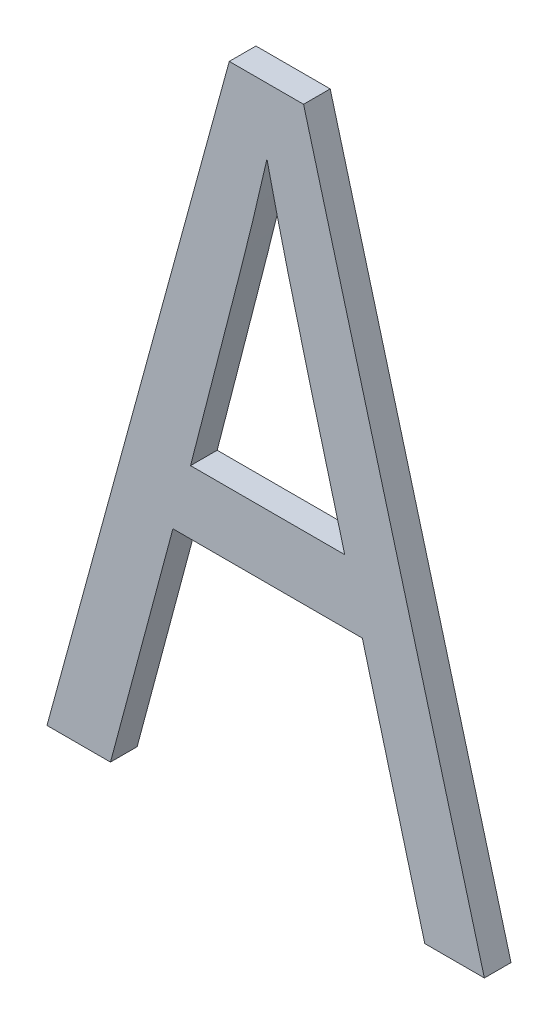
ISO-10303-21;
HEADER;
FILE_DESCRIPTION(('STEP AP214'),'2;1');
FILE_NAME('part.step','',(''),(''),'','','');
FILE_SCHEMA(('AUTOMOTIVE_DESIGN { 1 0 10303 214 1 1 1 1 }'));
ENDSEC;
DATA;
#1=APPLICATION_CONTEXT('core data for automotive mechanical design processes');
#2=APPLICATION_PROTOCOL_DEFINITION('international standard','automotive_design',2000,#1);
#3=PRODUCT_CONTEXT('',#1,'mechanical');
#4=PRODUCT('Part','Part','',(#3));
#5=PRODUCT_RELATED_PRODUCT_CATEGORY('part','',(#4));
#6=PRODUCT_DEFINITION_FORMATION('','',#4);
#7=PRODUCT_DEFINITION_CONTEXT('part definition',#1,'design');
#8=PRODUCT_DEFINITION('design','',#6,#7);
#9=PRODUCT_DEFINITION_SHAPE('','',#8);
#10=(LENGTH_UNIT() NAMED_UNIT(*) SI_UNIT(.MILLI.,.METRE.));
#11=(NAMED_UNIT(*) PLANE_ANGLE_UNIT() SI_UNIT($,.RADIAN.));
#12=(NAMED_UNIT(*) SI_UNIT($,.STERADIAN.) SOLID_ANGLE_UNIT());
#13=UNCERTAINTY_MEASURE_WITH_UNIT(LENGTH_MEASURE(1.E-05),#10,'distance_accuracy_value','');
#14=(GEOMETRIC_REPRESENTATION_CONTEXT(3) GLOBAL_UNCERTAINTY_ASSIGNED_CONTEXT((#13)) GLOBAL_UNIT_ASSIGNED_CONTEXT((#10,
#11,#12)) REPRESENTATION_CONTEXT('',''));
#15=CARTESIAN_POINT('',(0.,0.,0.));
#16=DIRECTION('',(0.,0.,1.));
#17=DIRECTION('',(1.,0.,0.));
#18=AXIS2_PLACEMENT_3D('',#15,#16,#17);
#19=CARTESIAN_POINT('',(182.438940877788,126.608883353261,-39.));
#20=DIRECTION('',(0.,0.,-1.));
#21=DIRECTION('',(-1.,0.,0.));
#22=AXIS2_PLACEMENT_3D('',#19,#20,#21);
#23=PLANE('',#22);
#24=CARTESIAN_POINT('',(182.575810186899,127.1671696976,-39.));
#25=CARTESIAN_POINT('',(182.561179192663,127.102124029348,-39.));
#26=CARTESIAN_POINT('',(182.546012391135,127.037201764327,-39.));
#27=CARTESIAN_POINT('',(182.514808215142,126.90756638735,-39.));
#28=CARTESIAN_POINT('',(182.498770841567,126.84285327518,-39.));
#29=CARTESIAN_POINT('',(182.466025413895,126.713594002499,-39.));
#30=CARTESIAN_POINT('',(182.449317314053,126.649047853696,-39.));
#31=CARTESIAN_POINT('',(182.420670535773,126.538090218466,-39.));
#32=CARTESIAN_POINT('',(182.408712019893,126.491683767088,-39.));
#33=CARTESIAN_POINT('',(182.384783693906,126.398873786968,-39.));
#34=CARTESIAN_POINT('',(182.372813883812,126.352470258223,-39.));
#35=CARTESIAN_POINT('',(182.34887865759,126.259668558141,-39.));
#36=CARTESIAN_POINT('',(182.336913241093,126.213270386897,-39.));
#37=CARTESIAN_POINT('',(182.312982394551,126.120473991871,-39.));
#38=CARTESIAN_POINT('',(182.301016964506,126.07407576809,-39.));
#39=CARTESIAN_POINT('',(182.289050121267,126.027677903,-39.));
#40=B_SPLINE_CURVE_WITH_KNOTS('',3,(#24,#25,#26,#27,#28,#29,#30,#31,#32,#33,#34,#35,#36,#37,#38,
#39),.UNSPECIFIED.,.F.,.F.,(4,2,2,2,2,2,2,4),(0.,0.200006503710284,0.400012802884781,
0.600032765794567,0.743800332480214,0.887567736364035,1.03131631891056,1.17506506422335),.UNSPECIFIED.);
#41=CARTESIAN_POINT('',(182.575810186899,127.1671696976,-39.));
#42=VERTEX_POINT('',#41);
#43=CARTESIAN_POINT('',(182.289050121267,126.027677903,-39.));
#44=VERTEX_POINT('',#43);
#45=EDGE_CURVE('E154',#42,#44,#40,.T.);
#46=ORIENTED_EDGE('',*,*,#45,.F.);
#47=CARTESIAN_POINT('',(182.867618845235,126.027677903,-39.));
#48=CARTESIAN_POINT('',(182.85908516722,126.059900398318,-39.));
#49=CARTESIAN_POINT('',(182.850521345555,126.092114882009,-39.));
#50=CARTESIAN_POINT('',(182.837650397628,126.140429887587,-39.));
#51=CARTESIAN_POINT('',(182.833355879711,126.156533767097,-39.));
#52=CARTESIAN_POINT('',(182.820464717402,126.204843373233,-39.));
#53=CARTESIAN_POINT('',(182.811860464369,126.237047067783,-39.));
#54=CARTESIAN_POINT('',(182.794658320957,126.301456160586,-39.));
#55=CARTESIAN_POINT('',(182.786060430577,126.333661558838,-39.));
#56=CARTESIAN_POINT('',(182.773188356578,126.381976253547,-39.));
#57=CARTESIAN_POINT('',(182.768901792142,126.398082251453,-39.));
#58=CARTESIAN_POINT('',(182.756059486557,126.44640488688,-39.));
#59=CARTESIAN_POINT('',(182.747521135929,126.478626155632,-39.));
#60=CARTESIAN_POINT('',(182.734768349427,126.526972489174,-39.));
#61=CARTESIAN_POINT('',(182.730526544226,126.543090337249,-39.));
#62=CARTESIAN_POINT('',(182.717833666571,126.591452473074,-39.));
#63=CARTESIAN_POINT('',(182.709415139857,126.623705323045,-39.));
#64=CARTESIAN_POINT('',(182.696871423184,126.672106358568,-39.));
#65=CARTESIAN_POINT('',(182.692704197878,126.688243658545,-39.));
#66=CARTESIAN_POINT('',(182.680255580832,126.736669308453,-39.));
#67=CARTESIAN_POINT('',(182.672027265874,126.768971339945,-39.));
#68=CARTESIAN_POINT('',(182.659802336479,126.817453951016,-39.));
#69=CARTESIAN_POINT('',(182.655746954098,126.833619734194,-39.));
#70=CARTESIAN_POINT('',(182.647677879117,126.865961709658,-39.));
#71=CARTESIAN_POINT('',(182.643664186519,126.882137901945,-39.));
#72=CARTESIAN_POINT('',(182.63568109633,126.914501218636,-39.));
#73=CARTESIAN_POINT('',(182.631711698743,126.93068834304,-39.));
#74=CARTESIAN_POINT('',(182.623820260627,126.963074128476,-39.));
#75=CARTESIAN_POINT('',(182.619898220104,126.979272789509,-39.));
#76=CARTESIAN_POINT('',(182.609130202649,127.024051528891,-39.));
#77=CARTESIAN_POINT('',(182.602337498995,127.052644456054,-39.));
#78=CARTESIAN_POINT('',(182.588932530445,127.109873700262,-39.));
#79=CARTESIAN_POINT('',(182.58232027244,127.138510018921,-39.));
#80=CARTESIAN_POINT('',(182.575810186899,127.1671696976,-39.));
#81=B_SPLINE_CURVE_WITH_KNOTS('',3,(#47,#48,#49,#50,#51,#52,#53,#54,#55,#56,#57,#58,#59,#60,#61,
#62,#63,#64,#65,#66,#67,#68,#69,#70,#71,#72,#73,#74,#75,#76,#77,#78,#79,#80),.UNSPECIFIED.,.F.,
.F.,(4,2,2,2,2,2,2,2,2,2,2,2,2,2,2,2,4),(0.,0.10000003182269,0.1500000331049,0.250000034672713,
0.350000037474405,0.400000039588166,0.500000076346735,0.550000085380904,0.650000194628294,
0.70000021647919,0.800000472344864,0.850000510762485,0.900000554003158,0.950000602989145,
1.00000065888165,1.08816620903135,1.17633512164849),.UNSPECIFIED.);
#82=CARTESIAN_POINT('',(182.867618845235,126.027677903,-39.));
#83=VERTEX_POINT('',#82);
#84=EDGE_CURVE('E24',#83,#42,#81,.T.);
#85=ORIENTED_EDGE('',*,*,#84,.F.);
#86=DIRECTION('',(1.,0.,0.));
#87=VECTOR('',#86,1.);
#88=CARTESIAN_POINT('',(182.867618845235,126.027677903,-39.));
#89=LINE('',#88,#87);
#90=EDGE_CURVE('E160',#44,#83,#89,.T.);
#91=ORIENTED_EDGE('',*,*,#90,.F.);
#92=EDGE_LOOP('',(#46,#85,#91));
#93=FACE_BOUND('',#92,.T.);
#94=DIRECTION('',(1.,0.,0.));
#95=VECTOR('',#94,1.);
#96=CARTESIAN_POINT('',(182.222913556834,125.789456621899,-39.));
#97=LINE('',#96,#95);
#98=CARTESIAN_POINT('',(182.933755409668,125.789456621899,-39.));
#99=VERTEX_POINT('',#98);
#100=CARTESIAN_POINT('',(182.222913556834,125.789456621899,-39.));
#101=VERTEX_POINT('',#100);
#102=EDGE_CURVE('E163',#99,#101,#97,.F.);
#103=ORIENTED_EDGE('',*,*,#102,.F.);
#104=DIRECTION('',(0.25848447954735,-0.966015410763791,0.));
#105=VECTOR('',#104,1.);
#106=CARTESIAN_POINT('',(182.933755409668,125.789456621899,-39.));
#107=LINE('',#106,#105);
#108=CARTESIAN_POINT('',(183.16801011117,124.913993413852,-39.));
#109=VERTEX_POINT('',#108);
#110=EDGE_CURVE('E169',#109,#99,#107,.F.);
#111=ORIENTED_EDGE('',*,*,#110,.F.);
#112=DIRECTION('',(1.,0.,0.));
#113=VECTOR('',#112,1.);
#114=CARTESIAN_POINT('',(183.16801011117,124.913993413852,-39.));
#115=LINE('',#114,#113);
#116=CARTESIAN_POINT('',(183.391662767992,124.913993413852,-39.));
#117=VERTEX_POINT('',#116);
#118=EDGE_CURVE('E174',#117,#109,#115,.F.);
#119=ORIENTED_EDGE('',*,*,#118,.F.);
#120=DIRECTION('',(-0.261936045239835,0.965085233647327,0.));
#121=VECTOR('',#120,1.);
#122=CARTESIAN_POINT('',(183.391662767992,124.913993413852,-39.));
#123=LINE('',#122,#121);
#124=CARTESIAN_POINT('',(182.713131908469,127.413993413853,-39.));
#125=VERTEX_POINT('',#124);
#126=EDGE_CURVE('E180',#125,#117,#123,.F.);
#127=ORIENTED_EDGE('',*,*,#126,.F.);
#128=DIRECTION('',(1.,0.,0.));
#129=VECTOR('',#128,1.);
#130=CARTESIAN_POINT('',(182.713131908469,127.413993413853,-39.));
#131=LINE('',#130,#129);
#132=CARTESIAN_POINT('',(182.434449591165,127.413993413853,-39.));
#133=VERTEX_POINT('',#132);
#134=EDGE_CURVE('E186',#133,#125,#131,.T.);
#135=ORIENTED_EDGE('',*,*,#134,.F.);
#136=DIRECTION('',(-0.263931093483598,-0.964541537670904,0.));
#137=VECTOR('',#136,1.);
#138=CARTESIAN_POINT('',(182.434449591165,127.413993413853,-39.));
#139=LINE('',#138,#137);
#140=CARTESIAN_POINT('',(181.750365279667,124.913993413852,-39.));
#141=VERTEX_POINT('',#140);
#142=EDGE_CURVE('E132',#141,#133,#139,.F.);
#143=ORIENTED_EDGE('',*,*,#142,.F.);
#144=DIRECTION('',(1.,0.,0.));
#145=VECTOR('',#144,1.);
#146=CARTESIAN_POINT('',(181.750365279667,124.913993413852,-39.));
#147=LINE('',#146,#145);
#148=CARTESIAN_POINT('',(181.988658855332,124.913993413852,-39.));
#149=VERTEX_POINT('',#148);
#150=EDGE_CURVE('E133',#149,#141,#147,.F.);
#151=ORIENTED_EDGE('',*,*,#150,.F.);
#152=DIRECTION('',(0.25848447954735,0.966015410763791,0.));
#153=VECTOR('',#152,1.);
#154=CARTESIAN_POINT('',(181.988658855332,124.913993413852,-39.));
#155=LINE('',#154,#153);
#156=EDGE_CURVE('E67',#101,#149,#155,.F.);
#157=ORIENTED_EDGE('',*,*,#156,.F.);
#158=EDGE_LOOP('',(#103,#111,#119,#127,#135,#143,#151,#157));
#159=FACE_BOUND('',#158,.T.);
#160=ADVANCED_FACE('F17',(#93,#159),#23,.F.);
#161=CARTESIAN_POINT('',(181.988658855332,124.913993413852,-39.1));
#162=DIRECTION('',(0.966015410763791,-0.25848447954735,0.));
#163=DIRECTION('',(0.25848447954735,0.966015410763791,0.));
#164=AXIS2_PLACEMENT_3D('',#161,#162,#163);
#165=PLANE('',#164);
#166=DIRECTION('',(-0.258484479547279,-0.96601541076381,0.));
#167=VECTOR('',#166,1.);
#168=CARTESIAN_POINT('',(182.222913556834,125.789456621899,-39.1));
#169=LINE('',#168,#167);
#170=CARTESIAN_POINT('',(182.222913556834,125.789456621899,-39.1));
#171=VERTEX_POINT('',#170);
#172=CARTESIAN_POINT('',(181.988658855332,124.913993413852,-39.1));
#173=VERTEX_POINT('',#172);
#174=EDGE_CURVE('E128',#171,#173,#169,.T.);
#175=ORIENTED_EDGE('',*,*,#174,.F.);
#176=DIRECTION('',(0.,0.,-1.));
#177=VECTOR('',#176,1.);
#178=CARTESIAN_POINT('',(182.222913556834,125.789456621899,-39.1));
#179=LINE('',#178,#177);
#180=EDGE_CURVE('E161',#101,#171,#179,.T.);
#181=ORIENTED_EDGE('',*,*,#180,.F.);
#182=ORIENTED_EDGE('',*,*,#156,.T.);
#183=DIRECTION('',(0.,0.,-1.));
#184=VECTOR('',#183,1.);
#185=CARTESIAN_POINT('',(181.988658855332,124.913993413852,-39.1));
#186=LINE('',#185,#184);
#187=EDGE_CURVE('E124',#173,#149,#186,.F.);
#188=ORIENTED_EDGE('',*,*,#187,.F.);
#189=EDGE_LOOP('',(#175,#181,#182,#188));
#190=FACE_BOUND('',#189,.T.);
#191=ADVANCED_FACE('F126',(#190),#165,.T.);
#192=CARTESIAN_POINT('',(181.750365279667,124.913993413852,-39.1));
#193=DIRECTION('',(0.,-1.,0.));
#194=DIRECTION('',(0.,0.,-1.));
#195=AXIS2_PLACEMENT_3D('',#192,#193,#194);
#196=PLANE('',#195);
#197=DIRECTION('',(-1.,0.,0.));
#198=VECTOR('',#197,1.);
#199=CARTESIAN_POINT('',(182.438940877788,124.913993413852,-39.1));
#200=LINE('',#199,#198);
#201=CARTESIAN_POINT('',(181.750365279667,124.913993413852,-39.1));
#202=VERTEX_POINT('',#201);
#203=EDGE_CURVE('E136',#173,#202,#200,.T.);
#204=ORIENTED_EDGE('',*,*,#203,.F.);
#205=ORIENTED_EDGE('',*,*,#187,.T.);
#206=ORIENTED_EDGE('',*,*,#150,.T.);
#207=DIRECTION('',(0.,0.,1.));
#208=VECTOR('',#207,1.);
#209=CARTESIAN_POINT('',(181.750365279667,124.913993413852,-39.1));
#210=LINE('',#209,#208);
#211=EDGE_CURVE('E139',#202,#141,#210,.T.);
#212=ORIENTED_EDGE('',*,*,#211,.F.);
#213=EDGE_LOOP('',(#204,#205,#206,#212));
#214=FACE_BOUND('',#213,.T.);
#215=ADVANCED_FACE('F137',(#214),#196,.T.);
#216=CARTESIAN_POINT('',(182.434449591165,127.413993413853,-39.1));
#217=DIRECTION('',(-0.964541537670904,0.263931093483598,0.));
#218=DIRECTION('',(-0.263931093483598,-0.964541537670904,0.));
#219=AXIS2_PLACEMENT_3D('',#216,#217,#218);
#220=PLANE('',#219);
#221=DIRECTION('',(0.26393109348362,0.964541537670898,0.));
#222=VECTOR('',#221,1.);
#223=CARTESIAN_POINT('',(181.750365279667,124.913993413852,-39.1));
#224=LINE('',#223,#222);
#225=CARTESIAN_POINT('',(182.434449591165,127.413993413853,-39.1));
#226=VERTEX_POINT('',#225);
#227=EDGE_CURVE('E143',#202,#226,#224,.T.);
#228=ORIENTED_EDGE('',*,*,#227,.F.);
#229=ORIENTED_EDGE('',*,*,#211,.T.);
#230=ORIENTED_EDGE('',*,*,#142,.T.);
#231=DIRECTION('',(0.,0.,1.));
#232=VECTOR('',#231,1.);
#233=CARTESIAN_POINT('',(182.434449591165,127.413993413853,-39.1));
#234=LINE('',#233,#232);
#235=EDGE_CURVE('E183',#226,#133,#234,.T.);
#236=ORIENTED_EDGE('',*,*,#235,.F.);
#237=EDGE_LOOP('',(#228,#229,#230,#236));
#238=FACE_BOUND('',#237,.T.);
#239=ADVANCED_FACE('F231',(#238),#220,.T.);
#240=CARTESIAN_POINT('',(182.713131908469,127.413993413853,-39.1));
#241=DIRECTION('',(0.,1.,0.));
#242=DIRECTION('',(0.,0.,1.));
#243=AXIS2_PLACEMENT_3D('',#240,#241,#242);
#244=PLANE('',#243);
#245=DIRECTION('',(-1.,0.,0.));
#246=VECTOR('',#245,1.);
#247=CARTESIAN_POINT('',(182.438940877788,127.413993413853,-39.1));
#248=LINE('',#247,#246);
#249=CARTESIAN_POINT('',(182.713131908469,127.413993413853,-39.1));
#250=VERTEX_POINT('',#249);
#251=EDGE_CURVE('E263',#226,#250,#248,.F.);
#252=ORIENTED_EDGE('',*,*,#251,.F.);
#253=ORIENTED_EDGE('',*,*,#235,.T.);
#254=ORIENTED_EDGE('',*,*,#134,.T.);
#255=DIRECTION('',(0.,0.,1.));
#256=VECTOR('',#255,1.);
#257=CARTESIAN_POINT('',(182.713131908469,127.413993413853,-39.1));
#258=LINE('',#257,#256);
#259=EDGE_CURVE('E177',#250,#125,#258,.T.);
#260=ORIENTED_EDGE('',*,*,#259,.F.);
#261=EDGE_LOOP('',(#252,#253,#254,#260));
#262=FACE_BOUND('',#261,.T.);
#263=ADVANCED_FACE('F227',(#262),#244,.T.);
#264=CARTESIAN_POINT('',(183.391662767992,124.913993413852,-39.1));
#265=DIRECTION('',(0.965085233647327,0.261936045239835,0.));
#266=DIRECTION('',(-0.261936045239835,0.965085233647327,0.));
#267=AXIS2_PLACEMENT_3D('',#264,#265,#266);
#268=PLANE('',#267);
#269=DIRECTION('',(0.261936045239823,-0.96508523364733,0.));
#270=VECTOR('',#269,1.);
#271=CARTESIAN_POINT('',(182.713131908469,127.413993413853,-39.1));
#272=LINE('',#271,#270);
#273=CARTESIAN_POINT('',(183.391662767992,124.913993413852,-39.1));
#274=VERTEX_POINT('',#273);
#275=EDGE_CURVE('E260',#250,#274,#272,.T.);
#276=ORIENTED_EDGE('',*,*,#275,.F.);
#277=ORIENTED_EDGE('',*,*,#259,.T.);
#278=ORIENTED_EDGE('',*,*,#126,.T.);
#279=DIRECTION('',(0.,0.,-1.));
#280=VECTOR('',#279,1.);
#281=CARTESIAN_POINT('',(183.391662767992,124.913993413852,-39.1));
#282=LINE('',#281,#280);
#283=EDGE_CURVE('E171',#274,#117,#282,.F.);
#284=ORIENTED_EDGE('',*,*,#283,.F.);
#285=EDGE_LOOP('',(#276,#277,#278,#284));
#286=FACE_BOUND('',#285,.T.);
#287=ADVANCED_FACE('F223',(#286),#268,.T.);
#288=CARTESIAN_POINT('',(183.16801011117,124.913993413852,-39.1));
#289=DIRECTION('',(0.,-1.,0.));
#290=DIRECTION('',(0.,0.,-1.));
#291=AXIS2_PLACEMENT_3D('',#288,#289,#290);
#292=PLANE('',#291);
#293=DIRECTION('',(-1.,0.,0.));
#294=VECTOR('',#293,1.);
#295=CARTESIAN_POINT('',(182.438940877788,124.913993413852,-39.1));
#296=LINE('',#295,#294);
#297=CARTESIAN_POINT('',(183.16801011117,124.913993413852,-39.1));
#298=VERTEX_POINT('',#297);
#299=EDGE_CURVE('E257',#274,#298,#296,.T.);
#300=ORIENTED_EDGE('',*,*,#299,.F.);
#301=ORIENTED_EDGE('',*,*,#283,.T.);
#302=ORIENTED_EDGE('',*,*,#118,.T.);
#303=DIRECTION('',(0.,0.,1.));
#304=VECTOR('',#303,1.);
#305=CARTESIAN_POINT('',(183.16801011117,124.913993413852,-39.1));
#306=LINE('',#305,#304);
#307=EDGE_CURVE('E166',#298,#109,#306,.T.);
#308=ORIENTED_EDGE('',*,*,#307,.F.);
#309=EDGE_LOOP('',(#300,#301,#302,#308));
#310=FACE_BOUND('',#309,.T.);
#311=ADVANCED_FACE('F220',(#310),#292,.T.);
#312=CARTESIAN_POINT('',(182.933755409668,125.789456621899,-39.1));
#313=DIRECTION('',(-0.966015410763791,-0.25848447954735,0.));
#314=DIRECTION('',(0.25848447954735,-0.966015410763791,0.));
#315=AXIS2_PLACEMENT_3D('',#312,#313,#314);
#316=PLANE('',#315);
#317=DIRECTION('',(-0.258484479547364,0.966015410763787,0.));
#318=VECTOR('',#317,1.);
#319=CARTESIAN_POINT('',(183.16801011117,124.913993413852,-39.1));
#320=LINE('',#319,#318);
#321=CARTESIAN_POINT('',(182.933755409668,125.789456621899,-39.1));
#322=VERTEX_POINT('',#321);
#323=EDGE_CURVE('E253',#298,#322,#320,.T.);
#324=ORIENTED_EDGE('',*,*,#323,.F.);
#325=ORIENTED_EDGE('',*,*,#307,.T.);
#326=ORIENTED_EDGE('',*,*,#110,.T.);
#327=DIRECTION('',(0.,0.,-1.));
#328=VECTOR('',#327,1.);
#329=CARTESIAN_POINT('',(182.933755409668,125.789456621899,-39.1));
#330=LINE('',#329,#328);
#331=EDGE_CURVE('E102',#322,#99,#330,.F.);
#332=ORIENTED_EDGE('',*,*,#331,.F.);
#333=EDGE_LOOP('',(#324,#325,#326,#332));
#334=FACE_BOUND('',#333,.T.);
#335=ADVANCED_FACE('F216',(#334),#316,.T.);
#336=CARTESIAN_POINT('',(182.222913556834,125.789456621899,-39.1));
#337=DIRECTION('',(0.,-1.,0.));
#338=DIRECTION('',(0.,0.,-1.));
#339=AXIS2_PLACEMENT_3D('',#336,#337,#338);
#340=PLANE('',#339);
#341=DIRECTION('',(-1.,0.,0.));
#342=VECTOR('',#341,1.);
#343=CARTESIAN_POINT('',(182.438940877788,125.789456621899,-39.1));
#344=LINE('',#343,#342);
#345=EDGE_CURVE('E148',#322,#171,#344,.T.);
#346=ORIENTED_EDGE('',*,*,#345,.F.);
#347=ORIENTED_EDGE('',*,*,#331,.T.);
#348=ORIENTED_EDGE('',*,*,#102,.T.);
#349=ORIENTED_EDGE('',*,*,#180,.T.);
#350=EDGE_LOOP('',(#346,#347,#348,#349));
#351=FACE_BOUND('',#350,.T.);
#352=ADVANCED_FACE('F213',(#351),#340,.T.);
#353=CARTESIAN_POINT('',(182.867618845235,126.027677903,-39.1));
#354=DIRECTION('',(0.,1.,0.));
#355=DIRECTION('',(0.,0.,1.));
#356=AXIS2_PLACEMENT_3D('',#353,#354,#355);
#357=PLANE('',#356);
#358=DIRECTION('',(-1.,0.,0.));
#359=VECTOR('',#358,1.);
#360=CARTESIAN_POINT('',(182.438940877788,126.027677903,-39.1));
#361=LINE('',#360,#359);
#362=CARTESIAN_POINT('',(182.289050121267,126.027677903,-39.1));
#363=VERTEX_POINT('',#362);
#364=CARTESIAN_POINT('',(182.867618845235,126.027677903,-39.1));
#365=VERTEX_POINT('',#364);
#366=EDGE_CURVE('E93',#363,#365,#361,.F.);
#367=ORIENTED_EDGE('',*,*,#366,.F.);
#368=DIRECTION('',(0.,0.,-1.));
#369=VECTOR('',#368,1.);
#370=CARTESIAN_POINT('',(182.289050121267,126.027677903,-39.05));
#371=LINE('',#370,#369);
#372=EDGE_CURVE('E150',#44,#363,#371,.T.);
#373=ORIENTED_EDGE('',*,*,#372,.F.);
#374=ORIENTED_EDGE('',*,*,#90,.T.);
#375=DIRECTION('',(0.,0.,1.));
#376=VECTOR('',#375,1.);
#377=CARTESIAN_POINT('',(182.867618845235,126.027677903,-39.05));
#378=LINE('',#377,#376);
#379=EDGE_CURVE('E156',#365,#83,#378,.T.);
#380=ORIENTED_EDGE('',*,*,#379,.F.);
#381=EDGE_LOOP('',(#367,#373,#374,#380));
#382=FACE_BOUND('',#381,.T.);
#383=ADVANCED_FACE('F208',(#382),#357,.T.);
#384=CARTESIAN_POINT('',(182.575810186899,127.1671696976,-39.1));
#385=CARTESIAN_POINT('',(182.575810186899,127.1671696976,-39.));
#386=CARTESIAN_POINT('',(182.608121180209,127.024898654721,-39.1));
#387=CARTESIAN_POINT('',(182.608121180209,127.024898654721,-39.));
#388=CARTESIAN_POINT('',(182.647500203307,126.863437564197,-39.1));
#389=CARTESIAN_POINT('',(182.647500203307,126.863437564197,-39.));
#390=CARTESIAN_POINT('',(182.750449071922,126.46449500019,-39.1));
#391=CARTESIAN_POINT('',(182.750449071922,126.46449500019,-39.));
#392=CARTESIAN_POINT('',(182.809728315554,126.246267985936,-39.1));
#393=CARTESIAN_POINT('',(182.809728315554,126.246267985936,-39.));
#394=CARTESIAN_POINT('',(182.867618845235,126.027677903,-39.1));
#395=CARTESIAN_POINT('',(182.867618845235,126.027677903,-39.));
#396=B_SPLINE_SURFACE_WITH_KNOTS('',3,1,((#384,#385),(#386,#387),(#388,#389),(#390,#391),(#392,
#393),(#394,#395)),.UNSPECIFIED.,.F.,.F.,.F.,(4,2,4),(2,2),(0.,0.45116622949396,1.),(1.,1.1),.UNSPECIFIED.);
#397=CARTESIAN_POINT('',(182.867618845235,126.027677903,-39.1));
#398=CARTESIAN_POINT('',(182.865485427379,126.035733520882,-39.1));
#399=CARTESIAN_POINT('',(182.863350125132,126.043788639469,-39.1));
#400=CARTESIAN_POINT('',(182.859076168832,126.05989798736,-39.1));
#401=CARTESIAN_POINT('',(182.856937514779,126.067952216665,-39.1));
#402=CARTESIAN_POINT('',(182.850517150179,126.092113735311,-39.1));
#403=CARTESIAN_POINT('',(182.846231037343,126.108219854827,-39.1));
#404=CARTESIAN_POINT('',(182.83765040669,126.14042985347,-39.1));
#405=CARTESIAN_POINT('',(182.833355888873,126.156533732598,-39.1));
#406=CARTESIAN_POINT('',(182.826910307785,126.180688535661,-39.1));
#407=CARTESIAN_POINT('',(182.82476114672,126.188739967318,-39.1));
#408=CARTESIAN_POINT('',(182.81831238603,126.212893921198,-39.1));
#409=CARTESIAN_POINT('',(182.81401150891,126.228996102329,-39.1));
#410=CARTESIAN_POINT('',(182.807560136925,126.253149358891,-39.1));
#411=CARTESIAN_POINT('',(182.805409670215,126.26120044188,-39.1));
#412=CARTESIAN_POINT('',(182.798958866552,126.285353850236,-39.1));
#413=CARTESIAN_POINT('',(182.794659126078,126.30145633494,-39.1));
#414=CARTESIAN_POINT('',(182.786064567329,126.333662618653,-39.1));
#415=CARTESIAN_POINT('',(182.781769749053,126.349766417662,-39.1));
#416=CARTESIAN_POINT('',(182.775333712936,126.373923765594,-39.1));
#417=CARTESIAN_POINT('',(182.773189399456,126.381976489775,-39.1));
#418=CARTESIAN_POINT('',(182.766760179381,126.40613565354,-39.1));
#419=CARTESIAN_POINT('',(182.762478993366,126.422243083551,-39.1));
#420=CARTESIAN_POINT('',(182.75392987787,126.454461463399,-39.1));
#421=CARTESIAN_POINT('',(182.749661948389,126.470572413235,-39.1));
#422=CARTESIAN_POINT('',(182.743272499327,126.494742126654,-39.1));
#423=CARTESIAN_POINT('',(182.741144757234,126.502799245647,-39.1));
#424=CARTESIAN_POINT('',(182.73476838079,126.52697241342,-39.1));
#425=CARTESIAN_POINT('',(182.730526596895,126.543090270657,-39.1));
#426=CARTESIAN_POINT('',(182.724180114374,126.567271303925,-39.1));
#427=CARTESIAN_POINT('',(182.722067319215,126.575332355759,-39.1));
#428=CARTESIAN_POINT('',(182.715737691235,126.599517808465,-39.1));
#429=CARTESIAN_POINT('',(182.711529616875,126.615644502881,-39.0999999999999));
#430=CARTESIAN_POINT('',(182.703139859924,126.647904759368,-39.1));
#431=CARTESIAN_POINT('',(182.698958177336,126.66403832144,-39.1));
#432=CARTESIAN_POINT('',(182.692708769537,126.688244629799,-39.1));
#433=CARTESIAN_POINT('',(182.690629486528,126.696314392515,-39.1));
#434=CARTESIAN_POINT('',(182.686479947575,126.712456238454,-39.1));
#435=CARTESIAN_POINT('',(182.684409691633,126.720528321677,-39.1));
#436=CARTESIAN_POINT('',(182.678212423389,126.744748037844,-39.1000000000001));
#437=CARTESIAN_POINT('',(182.674098912748,126.760899129231,-39.1));
#438=CARTESIAN_POINT('',(182.667957337955,126.785133027691,-39.1));
#439=CARTESIAN_POINT('',(182.665914928698,126.793212202164,-39.1));
#440=CARTESIAN_POINT('',(182.661839931891,126.809373028365,-39.1));
#441=CARTESIAN_POINT('',(182.659807344342,126.817454680092,-39.1));
#442=CARTESIAN_POINT('',(182.655752283558,126.833620520971,-39.1));
#443=CARTESIAN_POINT('',(182.653729810324,126.841704710122,-39.1));
#444=CARTESIAN_POINT('',(182.64969528392,126.857875687486,-39.1));
#445=CARTESIAN_POINT('',(182.647683230751,126.865962475698,-39.1));
#446=CARTESIAN_POINT('',(182.641663174428,126.890226853229,-39.1));
#447=CARTESIAN_POINT('',(182.637671277334,126.906408443999,-39.1));
#448=CARTESIAN_POINT('',(182.631717764163,126.930689234502,-39.1));
#449=CARTESIAN_POINT('',(182.629738982502,126.938784229371,-39.1));
#450=CARTESIAN_POINT('',(182.625793254258,126.954977103768,-39.1));
#451=CARTESIAN_POINT('',(182.623826307674,126.963074983294,-39.1));
#452=CARTESIAN_POINT('',(182.619904653023,126.979273706744,-39.1));
#453=CARTESIAN_POINT('',(182.617949944956,126.987374550667,-39.1));
#454=CARTESIAN_POINT('',(182.614053227559,127.003579287742,-39.1));
#455=CARTESIAN_POINT('',(182.612111218229,127.011683180894,-39.1));
#456=CARTESIAN_POINT('',(182.602433835367,127.052210681272,-39.1));
#457=CARTESIAN_POINT('',(182.594796582396,127.084657856382,-39.1));
#458=CARTESIAN_POINT('',(182.583425072724,127.133804563819,-39.1));
#459=CARTESIAN_POINT('',(182.579600165798,127.150483163702,-39.1));
#460=CARTESIAN_POINT('',(182.575810186899,127.1671696976,-39.1));
#461=B_SPLINE_CURVE_WITH_KNOTS('',3,(#397,#398,#399,#400,#401,#402,#403,#404,#405,#406,#407,
#408,#409,#410,#411,#412,#413,#414,#415,#416,#417,#418,#419,#420,#421,#422,#423,#424,#425,#426,
#427,#428,#429,#430,#431,#432,#433,#434,#435,#436,#437,#438,#439,#440,#441,#442,#443,#444,#445,
#446,#447,#448,#449,#450,#451,#452,#453,#454,#455,#456,#457,#458,#459,#460),.UNSPECIFIED.,.F.,
.F.,(4,2,2,2,2,2,2,2,2,2,2,2,2,2,2,2,2,2,2,2,2,2,2,2,2,2,2,2,2,2,2,4),(0.,0.0250000006345378,
0.050000001131756,0.100000003852933,0.150000005135185,0.17500000519668,0.225000005323716,
0.250000005324425,0.300000005500295,0.350000006377508,0.37500000661134,0.425000009544022,
0.475000014515894,0.500000015400904,0.550000024435016,0.575000025911383,0.625000040211842,
0.675000058691892,0.700000062069314,0.72500006585886,0.775000098385017,0.800000102836756,
0.825000107546751,0.85000011253725,0.875000117832969,0.92500016381758,0.95000017020857,
0.975000177037197,1.00000018434752,1.02500019218959,1.12500077488373,1.17633534139253),.UNSPECIFIED.);
#462=CARTESIAN_POINT('',(182.575810186899,127.1671696976,-39.1));
#463=VERTEX_POINT('',#462);
#464=EDGE_CURVE('E35',#365,#463,#461,.T.);
#465=DIRECTION('',(0.,0.,1.));
#466=VECTOR('',#465,1.);
#467=CARTESIAN_POINT('',(182.575810186899,127.1671696976,-39.05));
#468=LINE('',#467,#466);
#469=EDGE_CURVE('E44',#463,#42,#468,.T.);
#470=ORIENTED_EDGE('',*,*,#464,.F.);
#471=ORIENTED_EDGE('',*,*,#379,.T.);
#472=ORIENTED_EDGE('',*,*,#84,.T.);
#473=ORIENTED_EDGE('',*,*,#469,.F.);
#474=EDGE_LOOP('',(#470,#471,#472,#473));
#475=FACE_BOUND('',#474,.T.);
#476=ADVANCED_FACE('F212',(#475),#396,.T.);
#477=CARTESIAN_POINT('',(182.289050121267,126.027677903,-39.1));
#478=CARTESIAN_POINT('',(182.289050121267,126.027677903,-39.));
#479=CARTESIAN_POINT('',(182.34559435956,126.246929711717,-39.1));
#480=CARTESIAN_POINT('',(182.34559435956,126.246929711717,-39.));
#481=CARTESIAN_POINT('',(182.402138597854,126.466181520434,-39.1));
#482=CARTESIAN_POINT('',(182.402138597854,126.466181520434,-39.));
#483=CARTESIAN_POINT('',(182.502065768868,126.853651820609,-39.1));
#484=CARTESIAN_POINT('',(182.502065768868,126.853651820609,-39.));
#485=CARTESIAN_POINT('',(182.541479756506,127.014311042227,-39.1));
#486=CARTESIAN_POINT('',(182.541479756506,127.014311042227,-39.));
#487=CARTESIAN_POINT('',(182.575810186899,127.1671696976,-39.1));
#488=CARTESIAN_POINT('',(182.575810186899,127.1671696976,-39.));
#489=B_SPLINE_SURFACE_WITH_KNOTS('',3,1,((#477,#478),(#479,#480),(#481,#482),(#483,#484),(#485,
#486),(#487,#488)),.UNSPECIFIED.,.F.,.F.,.F.,(4,2,4),(2,2),(0.,0.565854489024155,1.),(1.,1.1),.UNSPECIFIED.);
#490=CARTESIAN_POINT('',(182.575810186899,127.1671696976,-39.1));
#491=CARTESIAN_POINT('',(182.561179192663,127.102124029348,-39.1));
#492=CARTESIAN_POINT('',(182.546012391135,127.037201764327,-39.1));
#493=CARTESIAN_POINT('',(182.514808215142,126.90756638735,-39.1));
#494=CARTESIAN_POINT('',(182.498770841567,126.84285327518,-39.1));
#495=CARTESIAN_POINT('',(182.466025413895,126.713594002499,-39.1));
#496=CARTESIAN_POINT('',(182.449317314053,126.649047853696,-39.1));
#497=CARTESIAN_POINT('',(182.420670535773,126.538090218466,-39.1));
#498=CARTESIAN_POINT('',(182.408712019893,126.491683767088,-39.1));
#499=CARTESIAN_POINT('',(182.384783693906,126.398873786968,-39.1));
#500=CARTESIAN_POINT('',(182.372813883812,126.352470258223,-39.1));
#501=CARTESIAN_POINT('',(182.34887865759,126.259668558141,-39.1));
#502=CARTESIAN_POINT('',(182.336913241093,126.213270386897,-39.1));
#503=CARTESIAN_POINT('',(182.312982394551,126.120473991871,-39.1));
#504=CARTESIAN_POINT('',(182.301016964506,126.07407576809,-39.1));
#505=CARTESIAN_POINT('',(182.289050121267,126.027677903,-39.1));
#506=B_SPLINE_CURVE_WITH_KNOTS('',3,(#490,#491,#492,#493,#494,#495,#496,#497,#498,#499,#500,
#501,#502,#503,#504,#505),.UNSPECIFIED.,.F.,.F.,(4,2,2,2,2,2,2,4),(0.,0.200006503710284,
0.400012802884775,0.60003276579456,0.743800332480214,0.887567736364036,1.03131631891056,
1.17506506422335),.UNSPECIFIED.);
#507=EDGE_CURVE('E11',#463,#363,#506,.T.);
#508=ORIENTED_EDGE('',*,*,#507,.F.);
#509=ORIENTED_EDGE('',*,*,#469,.T.);
#510=ORIENTED_EDGE('',*,*,#45,.T.);
#511=ORIENTED_EDGE('',*,*,#372,.T.);
#512=EDGE_LOOP('',(#508,#509,#510,#511));
#513=FACE_BOUND('',#512,.T.);
#514=ADVANCED_FACE('F19',(#513),#489,.T.);
#515=CARTESIAN_POINT('',(182.438940877788,126.608883353261,-39.1));
#516=DIRECTION('',(0.,0.,-1.));
#517=DIRECTION('',(-1.,0.,0.));
#518=AXIS2_PLACEMENT_3D('',#515,#516,#517);
#519=PLANE('',#518);
#520=ORIENTED_EDGE('',*,*,#464,.T.);
#521=ORIENTED_EDGE('',*,*,#507,.T.);
#522=ORIENTED_EDGE('',*,*,#366,.T.);
#523=EDGE_LOOP('',(#520,#521,#522));
#524=FACE_BOUND('',#523,.T.);
#525=ORIENTED_EDGE('',*,*,#323,.T.);
#526=ORIENTED_EDGE('',*,*,#345,.T.);
#527=ORIENTED_EDGE('',*,*,#174,.T.);
#528=ORIENTED_EDGE('',*,*,#203,.T.);
#529=ORIENTED_EDGE('',*,*,#227,.T.);
#530=ORIENTED_EDGE('',*,*,#251,.T.);
#531=ORIENTED_EDGE('',*,*,#275,.T.);
#532=ORIENTED_EDGE('',*,*,#299,.T.);
#533=EDGE_LOOP('',(#525,#526,#527,#528,#529,#530,#531,#532));
#534=FACE_BOUND('',#533,.T.);
#535=ADVANCED_FACE('F147',(#524,#534),#519,.T.);
#536=CLOSED_SHELL('',(#160,#191,#215,#239,#263,#287,#311,#335,#352,#383,#476,#514,#535));
#537=MANIFOLD_SOLID_BREP('B1',#536);
#538=ADVANCED_BREP_SHAPE_REPRESENTATION('',(#18,#537),#14);
#539=SHAPE_DEFINITION_REPRESENTATION(#9,#538);
ENDSEC;
END-ISO-10303-21;
